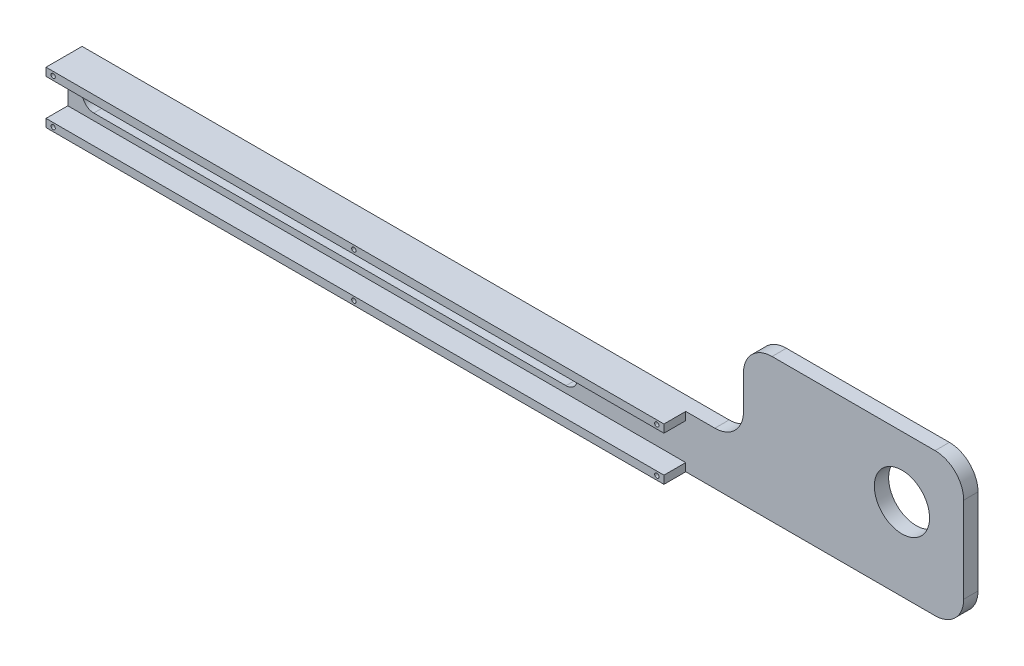
ISO-10303-21;
HEADER;
FILE_DESCRIPTION(('STEP AP214'),'2;1');
FILE_NAME('part.step','',(''),(''),'','','');
FILE_SCHEMA(('AUTOMOTIVE_DESIGN { 1 0 10303 214 1 1 1 1 }'));
ENDSEC;
DATA;
#1=APPLICATION_CONTEXT('core data for automotive mechanical design processes');
#2=APPLICATION_PROTOCOL_DEFINITION('international standard','automotive_design',2000,#1);
#3=PRODUCT_CONTEXT('',#1,'mechanical');
#4=PRODUCT('Part','Part','',(#3));
#5=PRODUCT_RELATED_PRODUCT_CATEGORY('part','',(#4));
#6=PRODUCT_DEFINITION_FORMATION('','',#4);
#7=PRODUCT_DEFINITION_CONTEXT('part definition',#1,'design');
#8=PRODUCT_DEFINITION('design','',#6,#7);
#9=PRODUCT_DEFINITION_SHAPE('','',#8);
#10=(LENGTH_UNIT() NAMED_UNIT(*) SI_UNIT(.MILLI.,.METRE.));
#11=(NAMED_UNIT(*) PLANE_ANGLE_UNIT() SI_UNIT($,.RADIAN.));
#12=(NAMED_UNIT(*) SI_UNIT($,.STERADIAN.) SOLID_ANGLE_UNIT());
#13=UNCERTAINTY_MEASURE_WITH_UNIT(LENGTH_MEASURE(1.E-05),#10,'distance_accuracy_value','');
#14=(GEOMETRIC_REPRESENTATION_CONTEXT(3) GLOBAL_UNCERTAINTY_ASSIGNED_CONTEXT((#13)) GLOBAL_UNIT_ASSIGNED_CONTEXT((#10,
#11,#12)) REPRESENTATION_CONTEXT('',''));
#15=CARTESIAN_POINT('',(0.,0.,0.));
#16=DIRECTION('',(0.,0.,1.));
#17=DIRECTION('',(1.,0.,0.));
#18=AXIS2_PLACEMENT_3D('',#15,#16,#17);
#19=CARTESIAN_POINT('',(0.,0.,5.));
#20=DIRECTION('',(0.,0.,1.));
#21=DIRECTION('',(1.,0.,0.));
#22=AXIS2_PLACEMENT_3D('',#19,#20,#21);
#23=PLANE('',#22);
#24=CARTESIAN_POINT('',(174.18,9.144,5.));
#25=DIRECTION('',(0.,0.,1.));
#26=DIRECTION('',(1.,0.,0.));
#27=AXIS2_PLACEMENT_3D('',#24,#25,#26);
#28=CIRCLE('',#27,4.);
#29=CARTESIAN_POINT('',(174.18,5.144,5.));
#30=VERTEX_POINT('',#29);
#31=CARTESIAN_POINT('',(174.18,13.144,5.));
#32=VERTEX_POINT('',#31);
#33=EDGE_CURVE('E267',#30,#32,#28,.T.);
#34=ORIENTED_EDGE('',*,*,#33,.F.);
#35=DIRECTION('',(1.,0.,0.));
#36=VECTOR('',#35,1.);
#37=CARTESIAN_POINT('',(0.,5.144,5.));
#38=LINE('',#37,#36);
#39=CARTESIAN_POINT('',(9.08,5.144,5.));
#40=VERTEX_POINT('',#39);
#41=EDGE_CURVE('E271',#40,#30,#38,.T.);
#42=ORIENTED_EDGE('',*,*,#41,.F.);
#43=CARTESIAN_POINT('',(9.08,9.144,5.));
#44=DIRECTION('',(0.,0.,1.));
#45=DIRECTION('',(1.,0.,0.));
#46=AXIS2_PLACEMENT_3D('',#43,#44,#45);
#47=CIRCLE('',#46,4.);
#48=CARTESIAN_POINT('',(9.08,13.144,5.));
#49=VERTEX_POINT('',#48);
#50=EDGE_CURVE('E276',#49,#40,#47,.T.);
#51=ORIENTED_EDGE('',*,*,#50,.F.);
#52=DIRECTION('',(1.,0.,0.));
#53=VECTOR('',#52,1.);
#54=CARTESIAN_POINT('',(0.,13.144,5.));
#55=LINE('',#54,#53);
#56=EDGE_CURVE('E280',#49,#32,#55,.T.);
#57=ORIENTED_EDGE('',*,*,#56,.T.);
#58=EDGE_LOOP('',(#34,#42,#51,#57));
#59=FACE_BOUND('',#58,.T.);
#60=CARTESIAN_POINT('',(291.63,28.638,5.));
#61=DIRECTION('',(0.,0.,1.));
#62=DIRECTION('',(1.,0.,0.));
#63=AXIS2_PLACEMENT_3D('',#60,#61,#62);
#64=CIRCLE('',#63,9.65199999999998);
#65=CARTESIAN_POINT('',(301.282,28.638,5.));
#66=VERTEX_POINT('',#65);
#67=EDGE_CURVE('E303',#66,#66,#64,.T.);
#68=ORIENTED_EDGE('',*,*,#67,.F.);
#69=EDGE_LOOP('',(#68));
#70=FACE_BOUND('',#69,.T.);
#71=DIRECTION('',(-1.,0.,0.));
#72=VECTOR('',#71,1.);
#73=CARTESIAN_POINT('',(0.,2.794,5.));
#74=LINE('',#73,#72);
#75=CARTESIAN_POINT('',(216.043861244439,2.79400000000005,5.));
#76=VERTEX_POINT('',#75);
#77=CARTESIAN_POINT('',(0.,2.794,5.));
#78=VERTEX_POINT('',#77);
#79=EDGE_CURVE('E209',#76,#78,#74,.T.);
#80=ORIENTED_EDGE('',*,*,#79,.F.);
#81=DIRECTION('',(0.,1.,0.));
#82=VECTOR('',#81,1.);
#83=CARTESIAN_POINT('',(216.043861244439,0.,5.));
#84=LINE('',#83,#82);
#85=CARTESIAN_POINT('',(216.043861244439,0.,5.));
#86=VERTEX_POINT('',#85);
#87=EDGE_CURVE('E212',#86,#76,#84,.T.);
#88=ORIENTED_EDGE('',*,*,#87,.F.);
#89=DIRECTION('',(1.,0.,0.));
#90=VECTOR('',#89,1.);
#91=CARTESIAN_POINT('',(0.,0.,5.));
#92=LINE('',#91,#90);
#93=CARTESIAN_POINT('',(303.22,0.,5.));
#94=VERTEX_POINT('',#93);
#95=EDGE_CURVE('E283',#86,#94,#92,.T.);
#96=ORIENTED_EDGE('',*,*,#95,.T.);
#97=CARTESIAN_POINT('',(303.22,10.,5.));
#98=DIRECTION('',(0.,0.,1.));
#99=DIRECTION('',(1.,0.,0.));
#100=AXIS2_PLACEMENT_3D('',#97,#98,#99);
#101=CIRCLE('',#100,10.);
#102=CARTESIAN_POINT('',(313.22,10.,5.));
#103=VERTEX_POINT('',#102);
#104=EDGE_CURVE('E385',#94,#103,#101,.T.);
#105=ORIENTED_EDGE('',*,*,#104,.T.);
#106=DIRECTION('',(0.,1.,0.));
#107=VECTOR('',#106,1.);
#108=CARTESIAN_POINT('',(313.22,0.,5.));
#109=LINE('',#108,#107);
#110=CARTESIAN_POINT('',(313.22,40.,5.));
#111=VERTEX_POINT('',#110);
#112=EDGE_CURVE('E286',#103,#111,#109,.T.);
#113=ORIENTED_EDGE('',*,*,#112,.T.);
#114=CARTESIAN_POINT('',(303.22,40.,5.));
#115=DIRECTION('',(0.,0.,1.));
#116=DIRECTION('',(1.,0.,0.));
#117=AXIS2_PLACEMENT_3D('',#114,#115,#116);
#118=CIRCLE('',#117,10.);
#119=CARTESIAN_POINT('',(303.22,50.,5.));
#120=VERTEX_POINT('',#119);
#121=EDGE_CURVE('E382',#111,#120,#118,.T.);
#122=ORIENTED_EDGE('',*,*,#121,.T.);
#123=DIRECTION('',(1.,0.,0.));
#124=VECTOR('',#123,1.);
#125=CARTESIAN_POINT('',(0.,50.,5.));
#126=LINE('',#125,#124);
#127=CARTESIAN_POINT('',(246.22,50.,5.));
#128=VERTEX_POINT('',#127);
#129=EDGE_CURVE('E290',#128,#120,#126,.T.);
#130=ORIENTED_EDGE('',*,*,#129,.F.);
#131=CARTESIAN_POINT('',(246.22,40.,5.));
#132=DIRECTION('',(0.,0.,1.));
#133=DIRECTION('',(1.,0.,0.));
#134=AXIS2_PLACEMENT_3D('',#131,#132,#133);
#135=CIRCLE('',#134,10.);
#136=CARTESIAN_POINT('',(236.22,40.,5.));
#137=VERTEX_POINT('',#136);
#138=EDGE_CURVE('E379',#128,#137,#135,.T.);
#139=ORIENTED_EDGE('',*,*,#138,.T.);
#140=DIRECTION('',(0.,1.,0.));
#141=VECTOR('',#140,1.);
#142=CARTESIAN_POINT('',(236.22,0.,5.));
#143=LINE('',#142,#141);
#144=CARTESIAN_POINT('',(236.22,28.288,5.));
#145=VERTEX_POINT('',#144);
#146=EDGE_CURVE('E294',#145,#137,#143,.T.);
#147=ORIENTED_EDGE('',*,*,#146,.F.);
#148=CARTESIAN_POINT('',(226.22,28.288,5.));
#149=DIRECTION('',(0.,0.,1.));
#150=DIRECTION('',(1.,0.,0.));
#151=AXIS2_PLACEMENT_3D('',#148,#149,#150);
#152=CIRCLE('',#151,10.);
#153=CARTESIAN_POINT('',(226.22,18.288,5.));
#154=VERTEX_POINT('',#153);
#155=EDGE_CURVE('E11',#145,#154,#152,.F.);
#156=ORIENTED_EDGE('',*,*,#155,.T.);
#157=DIRECTION('',(1.,0.,0.));
#158=VECTOR('',#157,1.);
#159=CARTESIAN_POINT('',(0.,18.288,5.));
#160=LINE('',#159,#158);
#161=CARTESIAN_POINT('',(216.043861244439,18.288,5.));
#162=VERTEX_POINT('',#161);
#163=EDGE_CURVE('E298',#162,#154,#160,.T.);
#164=ORIENTED_EDGE('',*,*,#163,.F.);
#165=DIRECTION('',(0.,1.,0.));
#166=VECTOR('',#165,1.);
#167=CARTESIAN_POINT('',(216.043861244439,18.288,5.));
#168=LINE('',#167,#166);
#169=CARTESIAN_POINT('',(216.043861244439,15.494,5.));
#170=VERTEX_POINT('',#169);
#171=EDGE_CURVE('E238',#170,#162,#168,.T.);
#172=ORIENTED_EDGE('',*,*,#171,.F.);
#173=DIRECTION('',(1.,0.,0.));
#174=VECTOR('',#173,1.);
#175=CARTESIAN_POINT('',(0.,15.494,5.));
#176=LINE('',#175,#174);
#177=CARTESIAN_POINT('',(0.,15.494,5.));
#178=VERTEX_POINT('',#177);
#179=EDGE_CURVE('E232',#178,#170,#176,.T.);
#180=ORIENTED_EDGE('',*,*,#179,.F.);
#181=DIRECTION('',(0.,1.,0.));
#182=VECTOR('',#181,1.);
#183=CARTESIAN_POINT('',(0.,0.,5.));
#184=LINE('',#183,#182);
#185=EDGE_CURVE('E65',#78,#178,#184,.T.);
#186=ORIENTED_EDGE('',*,*,#185,.F.);
#187=EDGE_LOOP('',(#80,#88,#96,#105,#113,#122,#130,#139,#147,#156,#164,#172,#180,#186));
#188=FACE_BOUND('',#187,.T.);
#189=ADVANCED_FACE('F41',(#59,#70,#188),#23,.T.);
#190=CARTESIAN_POINT('',(0.,0.,5.));
#191=DIRECTION('',(0.,1.,0.));
#192=DIRECTION('',(0.,0.,1.));
#193=AXIS2_PLACEMENT_3D('',#190,#191,#192);
#194=PLANE('',#193);
#195=DIRECTION('',(1.,0.,0.));
#196=VECTOR('',#195,1.);
#197=CARTESIAN_POINT('',(0.,0.,0.));
#198=LINE('',#197,#196);
#199=CARTESIAN_POINT('',(0.,0.,0.));
#200=VERTEX_POINT('',#199);
#201=CARTESIAN_POINT('',(303.22,0.,0.));
#202=VERTEX_POINT('',#201);
#203=EDGE_CURVE('E323',#200,#202,#198,.T.);
#204=ORIENTED_EDGE('',*,*,#203,.T.);
#205=DIRECTION('',(0.,0.,-1.));
#206=VECTOR('',#205,1.);
#207=CARTESIAN_POINT('',(303.22,0.,5.));
#208=LINE('',#207,#206);
#209=EDGE_CURVE('E375',#202,#94,#208,.F.);
#210=ORIENTED_EDGE('',*,*,#209,.T.);
#211=ORIENTED_EDGE('',*,*,#95,.F.);
#212=DIRECTION('',(0.,0.,-1.));
#213=VECTOR('',#212,1.);
#214=CARTESIAN_POINT('',(216.043861244439,0.,12.62));
#215=LINE('',#214,#213);
#216=CARTESIAN_POINT('',(216.043861244439,0.,12.62));
#217=VERTEX_POINT('',#216);
#218=EDGE_CURVE('E199',#217,#86,#215,.T.);
#219=ORIENTED_EDGE('',*,*,#218,.F.);
#220=DIRECTION('',(1.,0.,0.));
#221=VECTOR('',#220,1.);
#222=CARTESIAN_POINT('',(0.,0.,12.62));
#223=LINE('',#222,#221);
#224=CARTESIAN_POINT('',(0.,0.,12.62));
#225=VERTEX_POINT('',#224);
#226=EDGE_CURVE('E196',#225,#217,#223,.T.);
#227=ORIENTED_EDGE('',*,*,#226,.F.);
#228=DIRECTION('',(0.,0.,-1.));
#229=VECTOR('',#228,1.);
#230=CARTESIAN_POINT('',(0.,0.,5.));
#231=LINE('',#230,#229);
#232=EDGE_CURVE('E181',#225,#200,#231,.T.);
#233=ORIENTED_EDGE('',*,*,#232,.T.);
#234=EDGE_LOOP('',(#204,#210,#211,#219,#227,#233));
#235=FACE_BOUND('',#234,.T.);
#236=ADVANCED_FACE('F197',(#235),#194,.F.);
#237=CARTESIAN_POINT('',(313.22,0.,5.));
#238=DIRECTION('',(-1.,0.,0.));
#239=DIRECTION('',(0.,0.,1.));
#240=AXIS2_PLACEMENT_3D('',#237,#238,#239);
#241=PLANE('',#240);
#242=ORIENTED_EDGE('',*,*,#112,.F.);
#243=DIRECTION('',(0.,0.,-1.));
#244=VECTOR('',#243,1.);
#245=CARTESIAN_POINT('',(313.22,10.,5.));
#246=LINE('',#245,#244);
#247=CARTESIAN_POINT('',(313.22,10.,0.));
#248=VERTEX_POINT('',#247);
#249=EDGE_CURVE('E362',#103,#248,#246,.T.);
#250=ORIENTED_EDGE('',*,*,#249,.T.);
#251=DIRECTION('',(0.,1.,0.));
#252=VECTOR('',#251,1.);
#253=CARTESIAN_POINT('',(313.22,0.,0.));
#254=LINE('',#253,#252);
#255=CARTESIAN_POINT('',(313.22,40.,0.));
#256=VERTEX_POINT('',#255);
#257=EDGE_CURVE('E326',#248,#256,#254,.T.);
#258=ORIENTED_EDGE('',*,*,#257,.T.);
#259=DIRECTION('',(0.,0.,-1.));
#260=VECTOR('',#259,1.);
#261=CARTESIAN_POINT('',(313.22,40.,5.));
#262=LINE('',#261,#260);
#263=EDGE_CURVE('E349',#256,#111,#262,.F.);
#264=ORIENTED_EDGE('',*,*,#263,.T.);
#265=EDGE_LOOP('',(#242,#250,#258,#264));
#266=FACE_BOUND('',#265,.T.);
#267=ADVANCED_FACE('F437',(#266),#241,.F.);
#268=CARTESIAN_POINT('',(0.,50.,5.));
#269=DIRECTION('',(0.,1.,0.));
#270=DIRECTION('',(0.,0.,1.));
#271=AXIS2_PLACEMENT_3D('',#268,#269,#270);
#272=PLANE('',#271);
#273=ORIENTED_EDGE('',*,*,#129,.T.);
#274=DIRECTION('',(0.,0.,-1.));
#275=VECTOR('',#274,1.);
#276=CARTESIAN_POINT('',(303.22,50.,0.));
#277=LINE('',#276,#275);
#278=CARTESIAN_POINT('',(303.22,50.,0.));
#279=VERTEX_POINT('',#278);
#280=EDGE_CURVE('E391',#120,#279,#277,.T.);
#281=ORIENTED_EDGE('',*,*,#280,.T.);
#282=DIRECTION('',(1.,0.,0.));
#283=VECTOR('',#282,1.);
#284=CARTESIAN_POINT('',(0.,50.,0.));
#285=LINE('',#284,#283);
#286=CARTESIAN_POINT('',(246.22,50.,0.));
#287=VERTEX_POINT('',#286);
#288=EDGE_CURVE('E330',#287,#279,#285,.T.);
#289=ORIENTED_EDGE('',*,*,#288,.F.);
#290=DIRECTION('',(0.,0.,-1.));
#291=VECTOR('',#290,1.);
#292=CARTESIAN_POINT('',(246.22,50.,5.));
#293=LINE('',#292,#291);
#294=EDGE_CURVE('E388',#287,#128,#293,.F.);
#295=ORIENTED_EDGE('',*,*,#294,.T.);
#296=EDGE_LOOP('',(#273,#281,#289,#295));
#297=FACE_BOUND('',#296,.T.);
#298=ADVANCED_FACE('F429',(#297),#272,.T.);
#299=CARTESIAN_POINT('',(236.22,0.,5.));
#300=DIRECTION('',(-1.,0.,0.));
#301=DIRECTION('',(0.,0.,1.));
#302=AXIS2_PLACEMENT_3D('',#299,#300,#301);
#303=PLANE('',#302);
#304=ORIENTED_EDGE('',*,*,#146,.T.);
#305=DIRECTION('',(0.,0.,-1.));
#306=VECTOR('',#305,1.);
#307=CARTESIAN_POINT('',(236.22,40.,5.));
#308=LINE('',#307,#306);
#309=CARTESIAN_POINT('',(236.22,40.,0.));
#310=VERTEX_POINT('',#309);
#311=EDGE_CURVE('E398',#137,#310,#308,.T.);
#312=ORIENTED_EDGE('',*,*,#311,.T.);
#313=DIRECTION('',(0.,1.,0.));
#314=VECTOR('',#313,1.);
#315=CARTESIAN_POINT('',(236.22,0.,0.));
#316=LINE('',#315,#314);
#317=CARTESIAN_POINT('',(236.22,28.288,0.));
#318=VERTEX_POINT('',#317);
#319=EDGE_CURVE('E334',#318,#310,#316,.T.);
#320=ORIENTED_EDGE('',*,*,#319,.F.);
#321=DIRECTION('',(0.,0.,-1.));
#322=VECTOR('',#321,1.);
#323=CARTESIAN_POINT('',(236.22,28.288,5.));
#324=LINE('',#323,#322);
#325=EDGE_CURVE('E395',#318,#145,#324,.F.);
#326=ORIENTED_EDGE('',*,*,#325,.T.);
#327=EDGE_LOOP('',(#304,#312,#320,#326));
#328=FACE_BOUND('',#327,.T.);
#329=ADVANCED_FACE('F416',(#328),#303,.T.);
#330=CARTESIAN_POINT('',(0.,18.288,5.));
#331=DIRECTION('',(0.,1.,0.));
#332=DIRECTION('',(0.,0.,1.));
#333=AXIS2_PLACEMENT_3D('',#330,#331,#332);
#334=PLANE('',#333);
#335=DIRECTION('',(0.,0.,-1.));
#336=VECTOR('',#335,1.);
#337=CARTESIAN_POINT('',(0.,18.288,5.));
#338=LINE('',#337,#336);
#339=CARTESIAN_POINT('',(0.,18.288,12.62));
#340=VERTEX_POINT('',#339);
#341=CARTESIAN_POINT('',(0.,18.288,0.));
#342=VERTEX_POINT('',#341);
#343=EDGE_CURVE('E192',#340,#342,#338,.T.);
#344=ORIENTED_EDGE('',*,*,#343,.F.);
#345=DIRECTION('',(-1.,0.,0.));
#346=VECTOR('',#345,1.);
#347=CARTESIAN_POINT('',(0.,18.288,12.62));
#348=LINE('',#347,#346);
#349=CARTESIAN_POINT('',(216.043861244439,18.288,12.62));
#350=VERTEX_POINT('',#349);
#351=EDGE_CURVE('E244',#350,#340,#348,.T.);
#352=ORIENTED_EDGE('',*,*,#351,.F.);
#353=DIRECTION('',(0.,0.,-1.));
#354=VECTOR('',#353,1.);
#355=CARTESIAN_POINT('',(216.043861244439,18.288,12.62));
#356=LINE('',#355,#354);
#357=EDGE_CURVE('E248',#350,#162,#356,.T.);
#358=ORIENTED_EDGE('',*,*,#357,.T.);
#359=ORIENTED_EDGE('',*,*,#163,.T.);
#360=DIRECTION('',(0.,0.,-1.));
#361=VECTOR('',#360,1.);
#362=CARTESIAN_POINT('',(226.22,18.288,0.));
#363=LINE('',#362,#361);
#364=CARTESIAN_POINT('',(226.22,18.288,0.));
#365=VERTEX_POINT('',#364);
#366=EDGE_CURVE('E402',#154,#365,#363,.T.);
#367=ORIENTED_EDGE('',*,*,#366,.T.);
#368=DIRECTION('',(1.,0.,0.));
#369=VECTOR('',#368,1.);
#370=CARTESIAN_POINT('',(0.,18.288,0.));
#371=LINE('',#370,#369);
#372=EDGE_CURVE('E338',#342,#365,#371,.T.);
#373=ORIENTED_EDGE('',*,*,#372,.F.);
#374=EDGE_LOOP('',(#344,#352,#358,#359,#367,#373));
#375=FACE_BOUND('',#374,.T.);
#376=ADVANCED_FACE('F457',(#375),#334,.T.);
#377=CARTESIAN_POINT('',(174.18,9.144,5.));
#378=DIRECTION('',(0.,0.,-1.));
#379=DIRECTION('',(-1.,0.,0.));
#380=AXIS2_PLACEMENT_3D('',#377,#378,#379);
#381=CYLINDRICAL_SURFACE('',#380,4.);
#382=CARTESIAN_POINT('',(174.18,9.144,0.));
#383=DIRECTION('',(0.,0.,1.));
#384=DIRECTION('',(1.,0.,0.));
#385=AXIS2_PLACEMENT_3D('',#382,#383,#384);
#386=CIRCLE('',#385,4.);
#387=CARTESIAN_POINT('',(174.18,5.144,0.));
#388=VERTEX_POINT('',#387);
#389=CARTESIAN_POINT('',(174.18,13.144,0.));
#390=VERTEX_POINT('',#389);
#391=EDGE_CURVE('E266',#388,#390,#386,.T.);
#392=ORIENTED_EDGE('',*,*,#391,.F.);
#393=DIRECTION('',(0.,0.,-1.));
#394=VECTOR('',#393,1.);
#395=CARTESIAN_POINT('',(174.18,5.144,5.));
#396=LINE('',#395,#394);
#397=EDGE_CURVE('E193',#30,#388,#396,.T.);
#398=ORIENTED_EDGE('',*,*,#397,.F.);
#399=ORIENTED_EDGE('',*,*,#33,.T.);
#400=DIRECTION('',(0.,0.,-1.));
#401=VECTOR('',#400,1.);
#402=CARTESIAN_POINT('',(174.18,13.144,5.));
#403=LINE('',#402,#401);
#404=EDGE_CURVE('E307',#32,#390,#403,.T.);
#405=ORIENTED_EDGE('',*,*,#404,.T.);
#406=EDGE_LOOP('',(#392,#398,#399,#405));
#407=FACE_BOUND('',#406,.T.);
#408=ADVANCED_FACE('F492',(#407),#381,.F.);
#409=CARTESIAN_POINT('',(0.,5.144,5.));
#410=DIRECTION('',(0.,1.,0.));
#411=DIRECTION('',(0.,0.,1.));
#412=AXIS2_PLACEMENT_3D('',#409,#410,#411);
#413=PLANE('',#412);
#414=DIRECTION('',(1.,0.,0.));
#415=VECTOR('',#414,1.);
#416=CARTESIAN_POINT('',(0.,5.144,0.));
#417=LINE('',#416,#415);
#418=CARTESIAN_POINT('',(9.08,5.144,0.));
#419=VERTEX_POINT('',#418);
#420=EDGE_CURVE('E311',#419,#388,#417,.T.);
#421=ORIENTED_EDGE('',*,*,#420,.F.);
#422=DIRECTION('',(0.,0.,-1.));
#423=VECTOR('',#422,1.);
#424=CARTESIAN_POINT('',(9.08,5.144,5.));
#425=LINE('',#424,#423);
#426=EDGE_CURVE('E355',#40,#419,#425,.T.);
#427=ORIENTED_EDGE('',*,*,#426,.F.);
#428=ORIENTED_EDGE('',*,*,#41,.T.);
#429=ORIENTED_EDGE('',*,*,#397,.T.);
#430=EDGE_LOOP('',(#421,#427,#428,#429));
#431=FACE_BOUND('',#430,.T.);
#432=ADVANCED_FACE('F504',(#431),#413,.T.);
#433=CARTESIAN_POINT('',(9.08,9.144,5.));
#434=DIRECTION('',(0.,0.,-1.));
#435=DIRECTION('',(-1.,0.,0.));
#436=AXIS2_PLACEMENT_3D('',#433,#434,#435);
#437=CYLINDRICAL_SURFACE('',#436,4.);
#438=CARTESIAN_POINT('',(9.08,9.144,0.));
#439=DIRECTION('',(0.,0.,1.));
#440=DIRECTION('',(1.,0.,0.));
#441=AXIS2_PLACEMENT_3D('',#438,#439,#440);
#442=CIRCLE('',#441,4.);
#443=CARTESIAN_POINT('',(9.08,13.144,0.));
#444=VERTEX_POINT('',#443);
#445=EDGE_CURVE('E315',#444,#419,#442,.T.);
#446=ORIENTED_EDGE('',*,*,#445,.F.);
#447=DIRECTION('',(0.,0.,-1.));
#448=VECTOR('',#447,1.);
#449=CARTESIAN_POINT('',(9.08,13.144,5.));
#450=LINE('',#449,#448);
#451=EDGE_CURVE('E352',#49,#444,#450,.T.);
#452=ORIENTED_EDGE('',*,*,#451,.F.);
#453=ORIENTED_EDGE('',*,*,#50,.T.);
#454=ORIENTED_EDGE('',*,*,#426,.T.);
#455=EDGE_LOOP('',(#446,#452,#453,#454));
#456=FACE_BOUND('',#455,.T.);
#457=ADVANCED_FACE('F489',(#456),#437,.F.);
#458=CARTESIAN_POINT('',(0.,0.,5.));
#459=DIRECTION('',(-1.,0.,0.));
#460=DIRECTION('',(0.,0.,1.));
#461=AXIS2_PLACEMENT_3D('',#458,#459,#460);
#462=PLANE('',#461);
#463=DIRECTION('',(0.,1.,0.));
#464=VECTOR('',#463,1.);
#465=CARTESIAN_POINT('',(0.,0.,0.));
#466=LINE('',#465,#464);
#467=EDGE_CURVE('E187',#200,#342,#466,.T.);
#468=ORIENTED_EDGE('',*,*,#467,.F.);
#469=ORIENTED_EDGE('',*,*,#232,.F.);
#470=DIRECTION('',(0.,-1.,0.));
#471=VECTOR('',#470,1.);
#472=CARTESIAN_POINT('',(0.,0.,12.62));
#473=LINE('',#472,#471);
#474=CARTESIAN_POINT('',(0.,2.794,12.62));
#475=VERTEX_POINT('',#474);
#476=EDGE_CURVE('E185',#475,#225,#473,.T.);
#477=ORIENTED_EDGE('',*,*,#476,.F.);
#478=DIRECTION('',(0.,0.,-1.));
#479=VECTOR('',#478,1.);
#480=CARTESIAN_POINT('',(0.,2.794,12.62));
#481=LINE('',#480,#479);
#482=EDGE_CURVE('E222',#475,#78,#481,.T.);
#483=ORIENTED_EDGE('',*,*,#482,.T.);
#484=ORIENTED_EDGE('',*,*,#185,.T.);
#485=DIRECTION('',(0.,0.,-1.));
#486=VECTOR('',#485,1.);
#487=CARTESIAN_POINT('',(0.,15.494,12.62));
#488=LINE('',#487,#486);
#489=CARTESIAN_POINT('',(0.,15.494,12.62));
#490=VERTEX_POINT('',#489);
#491=EDGE_CURVE('E262',#490,#178,#488,.T.);
#492=ORIENTED_EDGE('',*,*,#491,.F.);
#493=DIRECTION('',(0.,-1.,0.));
#494=VECTOR('',#493,1.);
#495=CARTESIAN_POINT('',(0.,18.288,12.62));
#496=LINE('',#495,#494);
#497=EDGE_CURVE('E233',#340,#490,#496,.T.);
#498=ORIENTED_EDGE('',*,*,#497,.F.);
#499=ORIENTED_EDGE('',*,*,#343,.T.);
#500=EDGE_LOOP('',(#468,#469,#477,#483,#484,#492,#498,#499));
#501=FACE_BOUND('',#500,.T.);
#502=ADVANCED_FACE('F183',(#501),#462,.T.);
#503=CARTESIAN_POINT('',(0.,13.144,5.));
#504=DIRECTION('',(0.,1.,0.));
#505=DIRECTION('',(0.,0.,1.));
#506=AXIS2_PLACEMENT_3D('',#503,#504,#505);
#507=PLANE('',#506);
#508=DIRECTION('',(1.,0.,0.));
#509=VECTOR('',#508,1.);
#510=CARTESIAN_POINT('',(0.,13.144,0.));
#511=LINE('',#510,#509);
#512=EDGE_CURVE('E319',#444,#390,#511,.T.);
#513=ORIENTED_EDGE('',*,*,#512,.T.);
#514=ORIENTED_EDGE('',*,*,#404,.F.);
#515=ORIENTED_EDGE('',*,*,#56,.F.);
#516=ORIENTED_EDGE('',*,*,#451,.T.);
#517=EDGE_LOOP('',(#513,#514,#515,#516));
#518=FACE_BOUND('',#517,.T.);
#519=ADVANCED_FACE('F485',(#518),#507,.F.);
#520=CARTESIAN_POINT('',(291.63,28.638,5.));
#521=DIRECTION('',(0.,0.,-1.));
#522=DIRECTION('',(-1.,0.,0.));
#523=AXIS2_PLACEMENT_3D('',#520,#521,#522);
#524=CYLINDRICAL_SURFACE('',#523,9.65199999999998);
#525=ORIENTED_EDGE('',*,*,#67,.T.);
#526=EDGE_LOOP('',(#525));
#527=FACE_BOUND('',#526,.T.);
#528=CARTESIAN_POINT('',(291.63,28.638,0.));
#529=DIRECTION('',(0.,0.,1.));
#530=DIRECTION('',(1.,0.,0.));
#531=AXIS2_PLACEMENT_3D('',#528,#529,#530);
#532=CIRCLE('',#531,9.65199999999998);
#533=CARTESIAN_POINT('',(301.282,28.638,0.));
#534=VERTEX_POINT('',#533);
#535=EDGE_CURVE('E272',#534,#534,#532,.T.);
#536=ORIENTED_EDGE('',*,*,#535,.F.);
#537=EDGE_LOOP('',(#536));
#538=FACE_BOUND('',#537,.T.);
#539=ADVANCED_FACE('F481',(#527,#538),#524,.F.);
#540=CARTESIAN_POINT('',(0.,0.,0.));
#541=DIRECTION('',(0.,0.,1.));
#542=DIRECTION('',(1.,0.,0.));
#543=AXIS2_PLACEMENT_3D('',#540,#541,#542);
#544=PLANE('',#543);
#545=ORIENTED_EDGE('',*,*,#391,.T.);
#546=ORIENTED_EDGE('',*,*,#512,.F.);
#547=ORIENTED_EDGE('',*,*,#445,.T.);
#548=ORIENTED_EDGE('',*,*,#420,.T.);
#549=EDGE_LOOP('',(#545,#546,#547,#548));
#550=FACE_BOUND('',#549,.T.);
#551=ORIENTED_EDGE('',*,*,#257,.F.);
#552=CARTESIAN_POINT('',(303.22,10.,0.));
#553=DIRECTION('',(0.,0.,1.));
#554=DIRECTION('',(1.,0.,0.));
#555=AXIS2_PLACEMENT_3D('',#552,#553,#554);
#556=CIRCLE('',#555,10.);
#557=EDGE_CURVE('E372',#248,#202,#556,.F.);
#558=ORIENTED_EDGE('',*,*,#557,.T.);
#559=ORIENTED_EDGE('',*,*,#203,.F.);
#560=ORIENTED_EDGE('',*,*,#467,.T.);
#561=ORIENTED_EDGE('',*,*,#372,.T.);
#562=CARTESIAN_POINT('',(226.22,28.288,0.));
#563=DIRECTION('',(0.,0.,1.));
#564=DIRECTION('',(1.,0.,0.));
#565=AXIS2_PLACEMENT_3D('',#562,#563,#564);
#566=CIRCLE('',#565,10.);
#567=EDGE_CURVE('E50',#365,#318,#566,.T.);
#568=ORIENTED_EDGE('',*,*,#567,.T.);
#569=ORIENTED_EDGE('',*,*,#319,.T.);
#570=CARTESIAN_POINT('',(246.22,40.,0.));
#571=DIRECTION('',(0.,0.,1.));
#572=DIRECTION('',(1.,0.,0.));
#573=AXIS2_PLACEMENT_3D('',#570,#571,#572);
#574=CIRCLE('',#573,10.);
#575=EDGE_CURVE('E366',#310,#287,#574,.F.);
#576=ORIENTED_EDGE('',*,*,#575,.T.);
#577=ORIENTED_EDGE('',*,*,#288,.T.);
#578=CARTESIAN_POINT('',(303.22,40.,0.));
#579=DIRECTION('',(0.,0.,1.));
#580=DIRECTION('',(1.,0.,0.));
#581=AXIS2_PLACEMENT_3D('',#578,#579,#580);
#582=CIRCLE('',#581,10.);
#583=EDGE_CURVE('E369',#279,#256,#582,.F.);
#584=ORIENTED_EDGE('',*,*,#583,.T.);
#585=EDGE_LOOP('',(#551,#558,#559,#560,#561,#568,#569,#576,#577,#584));
#586=FACE_BOUND('',#585,.T.);
#587=ORIENTED_EDGE('',*,*,#535,.T.);
#588=EDGE_LOOP('',(#587));
#589=FACE_BOUND('',#588,.T.);
#590=ADVANCED_FACE('F409',(#550,#586,#589),#544,.F.);
#591=CARTESIAN_POINT('',(303.22,10.,5.));
#592=DIRECTION('',(0.,0.,-1.));
#593=DIRECTION('',(-1.,0.,0.));
#594=AXIS2_PLACEMENT_3D('',#591,#592,#593);
#595=CYLINDRICAL_SURFACE('',#594,10.);
#596=ORIENTED_EDGE('',*,*,#104,.F.);
#597=ORIENTED_EDGE('',*,*,#209,.F.);
#598=ORIENTED_EDGE('',*,*,#557,.F.);
#599=ORIENTED_EDGE('',*,*,#249,.F.);
#600=EDGE_LOOP('',(#596,#597,#598,#599));
#601=FACE_BOUND('',#600,.T.);
#602=ADVANCED_FACE('F441',(#601),#595,.T.);
#603=CARTESIAN_POINT('',(303.22,40.,5.));
#604=DIRECTION('',(0.,0.,1.));
#605=DIRECTION('',(1.,0.,0.));
#606=AXIS2_PLACEMENT_3D('',#603,#604,#605);
#607=CYLINDRICAL_SURFACE('',#606,10.);
#608=ORIENTED_EDGE('',*,*,#121,.F.);
#609=ORIENTED_EDGE('',*,*,#263,.F.);
#610=ORIENTED_EDGE('',*,*,#583,.F.);
#611=ORIENTED_EDGE('',*,*,#280,.F.);
#612=EDGE_LOOP('',(#608,#609,#610,#611));
#613=FACE_BOUND('',#612,.T.);
#614=ADVANCED_FACE('F433',(#613),#607,.T.);
#615=CARTESIAN_POINT('',(246.22,40.,5.));
#616=DIRECTION('',(0.,0.,-1.));
#617=DIRECTION('',(-1.,0.,0.));
#618=AXIS2_PLACEMENT_3D('',#615,#616,#617);
#619=CYLINDRICAL_SURFACE('',#618,10.);
#620=ORIENTED_EDGE('',*,*,#138,.F.);
#621=ORIENTED_EDGE('',*,*,#294,.F.);
#622=ORIENTED_EDGE('',*,*,#575,.F.);
#623=ORIENTED_EDGE('',*,*,#311,.F.);
#624=EDGE_LOOP('',(#620,#621,#622,#623));
#625=FACE_BOUND('',#624,.T.);
#626=ADVANCED_FACE('F425',(#625),#619,.T.);
#627=CARTESIAN_POINT('',(226.22,28.288,5.));
#628=DIRECTION('',(0.,0.,1.));
#629=DIRECTION('',(1.,0.,0.));
#630=AXIS2_PLACEMENT_3D('',#627,#628,#629);
#631=CYLINDRICAL_SURFACE('',#630,10.);
#632=ORIENTED_EDGE('',*,*,#155,.F.);
#633=ORIENTED_EDGE('',*,*,#325,.F.);
#634=ORIENTED_EDGE('',*,*,#567,.F.);
#635=ORIENTED_EDGE('',*,*,#366,.F.);
#636=EDGE_LOOP('',(#632,#633,#634,#635));
#637=FACE_BOUND('',#636,.T.);
#638=ADVANCED_FACE('F43',(#637),#631,.F.);
#639=CARTESIAN_POINT('',(0.,15.494,12.62));
#640=DIRECTION('',(0.,1.,0.));
#641=DIRECTION('',(0.,0.,1.));
#642=AXIS2_PLACEMENT_3D('',#639,#640,#641);
#643=PLANE('',#642);
#644=ORIENTED_EDGE('',*,*,#179,.T.);
#645=DIRECTION('',(0.,0.,-1.));
#646=VECTOR('',#645,1.);
#647=CARTESIAN_POINT('',(216.043861244439,15.494,12.62));
#648=LINE('',#647,#646);
#649=CARTESIAN_POINT('',(216.043861244439,15.494,12.62));
#650=VERTEX_POINT('',#649);
#651=EDGE_CURVE('E258',#650,#170,#648,.T.);
#652=ORIENTED_EDGE('',*,*,#651,.F.);
#653=DIRECTION('',(1.,0.,0.));
#654=VECTOR('',#653,1.);
#655=CARTESIAN_POINT('',(0.,15.494,12.62));
#656=LINE('',#655,#654);
#657=EDGE_CURVE('E237',#490,#650,#656,.T.);
#658=ORIENTED_EDGE('',*,*,#657,.F.);
#659=ORIENTED_EDGE('',*,*,#491,.T.);
#660=EDGE_LOOP('',(#644,#652,#658,#659));
#661=FACE_BOUND('',#660,.T.);
#662=ADVANCED_FACE('F449',(#661),#643,.F.);
#663=CARTESIAN_POINT('',(216.043861244439,18.288,12.62));
#664=DIRECTION('',(-1.,0.,0.));
#665=DIRECTION('',(0.,0.,1.));
#666=AXIS2_PLACEMENT_3D('',#663,#664,#665);
#667=PLANE('',#666);
#668=ORIENTED_EDGE('',*,*,#171,.T.);
#669=ORIENTED_EDGE('',*,*,#357,.F.);
#670=DIRECTION('',(0.,1.,0.));
#671=VECTOR('',#670,1.);
#672=CARTESIAN_POINT('',(216.043861244439,18.288,12.62));
#673=LINE('',#672,#671);
#674=EDGE_CURVE('E241',#650,#350,#673,.T.);
#675=ORIENTED_EDGE('',*,*,#674,.F.);
#676=ORIENTED_EDGE('',*,*,#651,.T.);
#677=EDGE_LOOP('',(#668,#669,#675,#676));
#678=FACE_BOUND('',#677,.T.);
#679=ADVANCED_FACE('F459',(#678),#667,.F.);
#680=CARTESIAN_POINT('',(0.,0.,12.62));
#681=DIRECTION('',(0.,0.,1.));
#682=DIRECTION('',(1.,0.,0.));
#683=AXIS2_PLACEMENT_3D('',#680,#681,#682);
#684=PLANE('',#683);
#685=CARTESIAN_POINT('',(213.543861244439,16.891,12.62));
#686=DIRECTION('',(0.,0.,1.));
#687=DIRECTION('',(1.,0.,0.));
#688=AXIS2_PLACEMENT_3D('',#685,#686,#687);
#689=CIRCLE('',#688,0.750000000000012);
#690=CARTESIAN_POINT('',(214.293861244439,16.891,12.62));
#691=VERTEX_POINT('',#690);
#692=EDGE_CURVE('E693',#691,#691,#689,.T.);
#693=ORIENTED_EDGE('',*,*,#692,.F.);
#694=EDGE_LOOP('',(#693));
#695=FACE_BOUND('',#694,.T.);
#696=CARTESIAN_POINT('',(107.632192199668,16.891,12.62));
#697=DIRECTION('',(0.,0.,1.));
#698=DIRECTION('',(1.,0.,0.));
#699=AXIS2_PLACEMENT_3D('',#696,#697,#698);
#700=CIRCLE('',#699,0.749999999999999);
#701=CARTESIAN_POINT('',(108.382192199668,16.891,12.62));
#702=VERTEX_POINT('',#701);
#703=EDGE_CURVE('E717',#702,#702,#700,.T.);
#704=ORIENTED_EDGE('',*,*,#703,.F.);
#705=EDGE_LOOP('',(#704));
#706=FACE_BOUND('',#705,.T.);
#707=CARTESIAN_POINT('',(2.5,16.891,12.62));
#708=DIRECTION('',(0.,0.,1.));
#709=DIRECTION('',(1.,0.,0.));
#710=AXIS2_PLACEMENT_3D('',#707,#708,#709);
#711=CIRCLE('',#710,0.75);
#712=CARTESIAN_POINT('',(3.25,16.891,12.62));
#713=VERTEX_POINT('',#712);
#714=EDGE_CURVE('E215',#713,#713,#711,.T.);
#715=ORIENTED_EDGE('',*,*,#714,.F.);
#716=EDGE_LOOP('',(#715));
#717=FACE_BOUND('',#716,.T.);
#718=ORIENTED_EDGE('',*,*,#497,.T.);
#719=ORIENTED_EDGE('',*,*,#657,.T.);
#720=ORIENTED_EDGE('',*,*,#674,.T.);
#721=ORIENTED_EDGE('',*,*,#351,.T.);
#722=EDGE_LOOP('',(#718,#719,#720,#721));
#723=FACE_BOUND('',#722,.T.);
#724=ADVANCED_FACE('F452',(#695,#706,#717,#723),#684,.T.);
#725=CARTESIAN_POINT('',(216.043861244439,0.,12.62));
#726=DIRECTION('',(-1.,0.,0.));
#727=DIRECTION('',(0.,0.,1.));
#728=AXIS2_PLACEMENT_3D('',#725,#726,#727);
#729=PLANE('',#728);
#730=ORIENTED_EDGE('',*,*,#87,.T.);
#731=DIRECTION('',(0.,0.,-1.));
#732=VECTOR('',#731,1.);
#733=CARTESIAN_POINT('',(216.043861244439,2.79400000000005,12.62));
#734=LINE('',#733,#732);
#735=CARTESIAN_POINT('',(216.043861244439,2.79400000000005,12.62));
#736=VERTEX_POINT('',#735);
#737=EDGE_CURVE('E57',#736,#76,#734,.T.);
#738=ORIENTED_EDGE('',*,*,#737,.F.);
#739=DIRECTION('',(0.,1.,0.));
#740=VECTOR('',#739,1.);
#741=CARTESIAN_POINT('',(216.043861244439,0.,12.62));
#742=LINE('',#741,#740);
#743=EDGE_CURVE('E203',#217,#736,#742,.T.);
#744=ORIENTED_EDGE('',*,*,#743,.F.);
#745=ORIENTED_EDGE('',*,*,#218,.T.);
#746=EDGE_LOOP('',(#730,#738,#744,#745));
#747=FACE_BOUND('',#746,.T.);
#748=ADVANCED_FACE('F445',(#747),#729,.F.);
#749=CARTESIAN_POINT('',(0.,2.794,12.62));
#750=DIRECTION('',(0.,-1.,0.));
#751=DIRECTION('',(1.,0.,0.));
#752=AXIS2_PLACEMENT_3D('',#749,#750,#751);
#753=PLANE('',#752);
#754=ORIENTED_EDGE('',*,*,#79,.T.);
#755=ORIENTED_EDGE('',*,*,#482,.F.);
#756=DIRECTION('',(-1.,0.,0.));
#757=VECTOR('',#756,1.);
#758=CARTESIAN_POINT('',(0.,2.794,12.62));
#759=LINE('',#758,#757);
#760=EDGE_CURVE('E206',#736,#475,#759,.T.);
#761=ORIENTED_EDGE('',*,*,#760,.F.);
#762=ORIENTED_EDGE('',*,*,#737,.T.);
#763=EDGE_LOOP('',(#754,#755,#761,#762));
#764=FACE_BOUND('',#763,.T.);
#765=ADVANCED_FACE('F446',(#764),#753,.F.);
#766=CARTESIAN_POINT('',(0.,0.,12.62));
#767=DIRECTION('',(0.,0.,-1.));
#768=DIRECTION('',(-1.,0.,0.));
#769=AXIS2_PLACEMENT_3D('',#766,#767,#768);
#770=PLANE('',#769);
#771=CARTESIAN_POINT('',(107.632192199668,1.397,12.62));
#772=DIRECTION('',(0.,0.,1.));
#773=DIRECTION('',(1.,0.,0.));
#774=AXIS2_PLACEMENT_3D('',#771,#772,#773);
#775=CIRCLE('',#774,0.749999999999999);
#776=CARTESIAN_POINT('',(108.382192199668,1.397,12.62));
#777=VERTEX_POINT('',#776);
#778=EDGE_CURVE('E692',#777,#777,#775,.F.);
#779=ORIENTED_EDGE('',*,*,#778,.T.);
#780=EDGE_LOOP('',(#779));
#781=FACE_BOUND('',#780,.T.);
#782=CARTESIAN_POINT('',(2.5,1.397,12.62));
#783=DIRECTION('',(0.,0.,1.));
#784=DIRECTION('',(1.,0.,0.));
#785=AXIS2_PLACEMENT_3D('',#782,#783,#784);
#786=CIRCLE('',#785,0.75);
#787=CARTESIAN_POINT('',(3.25,1.397,12.62));
#788=VERTEX_POINT('',#787);
#789=EDGE_CURVE('E709',#788,#788,#786,.F.);
#790=ORIENTED_EDGE('',*,*,#789,.T.);
#791=EDGE_LOOP('',(#790));
#792=FACE_BOUND('',#791,.T.);
#793=CARTESIAN_POINT('',(213.543861244439,1.397,12.62));
#794=DIRECTION('',(0.,0.,1.));
#795=DIRECTION('',(1.,0.,0.));
#796=AXIS2_PLACEMENT_3D('',#793,#794,#795);
#797=CIRCLE('',#796,0.750000000000012);
#798=CARTESIAN_POINT('',(214.293861244439,1.397,12.62));
#799=VERTEX_POINT('',#798);
#800=EDGE_CURVE('E732',#799,#799,#797,.F.);
#801=ORIENTED_EDGE('',*,*,#800,.T.);
#802=EDGE_LOOP('',(#801));
#803=FACE_BOUND('',#802,.T.);
#804=ORIENTED_EDGE('',*,*,#476,.T.);
#805=ORIENTED_EDGE('',*,*,#226,.T.);
#806=ORIENTED_EDGE('',*,*,#743,.T.);
#807=ORIENTED_EDGE('',*,*,#760,.T.);
#808=EDGE_LOOP('',(#804,#805,#806,#807));
#809=FACE_BOUND('',#808,.T.);
#810=ADVANCED_FACE('F205',(#781,#792,#803,#809),#770,.F.);
#811=CARTESIAN_POINT('',(213.543861244439,1.397,7.62));
#812=DIRECTION('',(0.,0.,1.));
#813=DIRECTION('',(1.,0.,0.));
#814=AXIS2_PLACEMENT_3D('',#811,#812,#813);
#815=CYLINDRICAL_SURFACE('',#814,0.750000000000012);
#816=CARTESIAN_POINT('',(213.543861244439,1.397,7.62));
#817=DIRECTION('',(0.,0.,1.));
#818=DIRECTION('',(1.,0.,0.));
#819=AXIS2_PLACEMENT_3D('',#816,#817,#818);
#820=CIRCLE('',#819,0.750000000000012);
#821=CARTESIAN_POINT('',(214.293861244439,1.397,7.62));
#822=VERTEX_POINT('',#821);
#823=EDGE_CURVE('E701',#822,#822,#820,.F.);
#824=ORIENTED_EDGE('',*,*,#823,.T.);
#825=EDGE_LOOP('',(#824));
#826=FACE_BOUND('',#825,.T.);
#827=ORIENTED_EDGE('',*,*,#800,.F.);
#828=EDGE_LOOP('',(#827));
#829=FACE_BOUND('',#828,.T.);
#830=ADVANCED_FACE('F564',(#826,#829),#815,.F.);
#831=CARTESIAN_POINT('',(0.,0.,7.62));
#832=DIRECTION('',(0.,0.,1.));
#833=DIRECTION('',(1.,0.,0.));
#834=AXIS2_PLACEMENT_3D('',#831,#832,#833);
#835=PLANE('',#834);
#836=ORIENTED_EDGE('',*,*,#823,.F.);
#837=EDGE_LOOP('',(#836));
#838=FACE_BOUND('',#837,.T.);
#839=ADVANCED_FACE('F574',(#838),#835,.T.);
#840=CARTESIAN_POINT('',(2.5,1.397,7.62));
#841=DIRECTION('',(0.,0.,1.));
#842=DIRECTION('',(1.,0.,0.));
#843=AXIS2_PLACEMENT_3D('',#840,#841,#842);
#844=CYLINDRICAL_SURFACE('',#843,0.75);
#845=CARTESIAN_POINT('',(2.5,1.397,7.62));
#846=DIRECTION('',(0.,0.,1.));
#847=DIRECTION('',(1.,0.,0.));
#848=AXIS2_PLACEMENT_3D('',#845,#846,#847);
#849=CIRCLE('',#848,0.75);
#850=CARTESIAN_POINT('',(3.25,1.397,7.62));
#851=VERTEX_POINT('',#850);
#852=EDGE_CURVE('E705',#851,#851,#849,.F.);
#853=ORIENTED_EDGE('',*,*,#852,.T.);
#854=EDGE_LOOP('',(#853));
#855=FACE_BOUND('',#854,.T.);
#856=ORIENTED_EDGE('',*,*,#789,.F.);
#857=EDGE_LOOP('',(#856));
#858=FACE_BOUND('',#857,.T.);
#859=ADVANCED_FACE('F584',(#855,#858),#844,.F.);
#860=CARTESIAN_POINT('',(0.,0.,7.62));
#861=DIRECTION('',(0.,0.,1.));
#862=DIRECTION('',(1.,0.,0.));
#863=AXIS2_PLACEMENT_3D('',#860,#861,#862);
#864=PLANE('',#863);
#865=ORIENTED_EDGE('',*,*,#852,.F.);
#866=EDGE_LOOP('',(#865));
#867=FACE_BOUND('',#866,.T.);
#868=ADVANCED_FACE('F594',(#867),#864,.T.);
#869=CARTESIAN_POINT('',(107.632192199668,1.397,7.62));
#870=DIRECTION('',(0.,0.,1.));
#871=DIRECTION('',(1.,0.,0.));
#872=AXIS2_PLACEMENT_3D('',#869,#870,#871);
#873=CYLINDRICAL_SURFACE('',#872,0.749999999999999);
#874=CARTESIAN_POINT('',(107.632192199668,1.397,7.62));
#875=DIRECTION('',(0.,0.,1.));
#876=DIRECTION('',(1.,0.,0.));
#877=AXIS2_PLACEMENT_3D('',#874,#875,#876);
#878=CIRCLE('',#877,0.749999999999999);
#879=CARTESIAN_POINT('',(108.382192199668,1.397,7.62));
#880=VERTEX_POINT('',#879);
#881=EDGE_CURVE('E698',#880,#880,#878,.F.);
#882=ORIENTED_EDGE('',*,*,#881,.T.);
#883=EDGE_LOOP('',(#882));
#884=FACE_BOUND('',#883,.T.);
#885=ORIENTED_EDGE('',*,*,#778,.F.);
#886=EDGE_LOOP('',(#885));
#887=FACE_BOUND('',#886,.T.);
#888=ADVANCED_FACE('F604',(#884,#887),#873,.F.);
#889=CARTESIAN_POINT('',(0.,0.,7.62));
#890=DIRECTION('',(0.,0.,1.));
#891=DIRECTION('',(1.,0.,0.));
#892=AXIS2_PLACEMENT_3D('',#889,#890,#891);
#893=PLANE('',#892);
#894=ORIENTED_EDGE('',*,*,#881,.F.);
#895=EDGE_LOOP('',(#894));
#896=FACE_BOUND('',#895,.T.);
#897=ADVANCED_FACE('F614',(#896),#893,.T.);
#898=CARTESIAN_POINT('',(2.5,16.891,7.62));
#899=DIRECTION('',(0.,0.,1.));
#900=DIRECTION('',(1.,0.,0.));
#901=AXIS2_PLACEMENT_3D('',#898,#899,#900);
#902=CYLINDRICAL_SURFACE('',#901,0.75);
#903=CARTESIAN_POINT('',(2.5,16.891,7.62));
#904=DIRECTION('',(0.,0.,1.));
#905=DIRECTION('',(1.,0.,0.));
#906=AXIS2_PLACEMENT_3D('',#903,#904,#905);
#907=CIRCLE('',#906,0.75);
#908=CARTESIAN_POINT('',(3.25,16.891,7.62));
#909=VERTEX_POINT('',#908);
#910=EDGE_CURVE('E224',#909,#909,#907,.T.);
#911=ORIENTED_EDGE('',*,*,#910,.F.);
#912=EDGE_LOOP('',(#911));
#913=FACE_BOUND('',#912,.T.);
#914=ORIENTED_EDGE('',*,*,#714,.T.);
#915=EDGE_LOOP('',(#914));
#916=FACE_BOUND('',#915,.T.);
#917=ADVANCED_FACE('F624',(#913,#916),#902,.F.);
#918=CARTESIAN_POINT('',(0.,0.,7.62));
#919=DIRECTION('',(0.,0.,1.));
#920=DIRECTION('',(1.,0.,0.));
#921=AXIS2_PLACEMENT_3D('',#918,#919,#920);
#922=PLANE('',#921);
#923=ORIENTED_EDGE('',*,*,#910,.T.);
#924=EDGE_LOOP('',(#923));
#925=FACE_BOUND('',#924,.T.);
#926=ADVANCED_FACE('F634',(#925),#922,.T.);
#927=CARTESIAN_POINT('',(107.632192199668,16.891,7.62));
#928=DIRECTION('',(0.,0.,1.));
#929=DIRECTION('',(1.,0.,0.));
#930=AXIS2_PLACEMENT_3D('',#927,#928,#929);
#931=CYLINDRICAL_SURFACE('',#930,0.749999999999999);
#932=CARTESIAN_POINT('',(107.632192199668,16.891,7.62));
#933=DIRECTION('',(0.,0.,1.));
#934=DIRECTION('',(1.,0.,0.));
#935=AXIS2_PLACEMENT_3D('',#932,#933,#934);
#936=CIRCLE('',#935,0.749999999999999);
#937=CARTESIAN_POINT('',(108.382192199668,16.891,7.62));
#938=VERTEX_POINT('',#937);
#939=EDGE_CURVE('E713',#938,#938,#936,.T.);
#940=ORIENTED_EDGE('',*,*,#939,.F.);
#941=EDGE_LOOP('',(#940));
#942=FACE_BOUND('',#941,.T.);
#943=ORIENTED_EDGE('',*,*,#703,.T.);
#944=EDGE_LOOP('',(#943));
#945=FACE_BOUND('',#944,.T.);
#946=ADVANCED_FACE('F644',(#942,#945),#931,.F.);
#947=CARTESIAN_POINT('',(0.,0.,7.62));
#948=DIRECTION('',(0.,0.,1.));
#949=DIRECTION('',(1.,0.,0.));
#950=AXIS2_PLACEMENT_3D('',#947,#948,#949);
#951=PLANE('',#950);
#952=ORIENTED_EDGE('',*,*,#939,.T.);
#953=EDGE_LOOP('',(#952));
#954=FACE_BOUND('',#953,.T.);
#955=ADVANCED_FACE('F654',(#954),#951,.T.);
#956=CARTESIAN_POINT('',(213.543861244439,16.891,7.62));
#957=DIRECTION('',(0.,0.,1.));
#958=DIRECTION('',(1.,0.,0.));
#959=AXIS2_PLACEMENT_3D('',#956,#957,#958);
#960=CYLINDRICAL_SURFACE('',#959,0.750000000000012);
#961=CARTESIAN_POINT('',(213.543861244439,16.891,7.62));
#962=DIRECTION('',(0.,0.,1.));
#963=DIRECTION('',(1.,0.,0.));
#964=AXIS2_PLACEMENT_3D('',#961,#962,#963);
#965=CIRCLE('',#964,0.750000000000012);
#966=CARTESIAN_POINT('',(214.293861244439,16.891,7.62));
#967=VERTEX_POINT('',#966);
#968=EDGE_CURVE('E690',#967,#967,#965,.T.);
#969=ORIENTED_EDGE('',*,*,#968,.F.);
#970=EDGE_LOOP('',(#969));
#971=FACE_BOUND('',#970,.T.);
#972=ORIENTED_EDGE('',*,*,#692,.T.);
#973=EDGE_LOOP('',(#972));
#974=FACE_BOUND('',#973,.T.);
#975=ADVANCED_FACE('F664',(#971,#974),#960,.F.);
#976=CARTESIAN_POINT('',(0.,0.,7.62));
#977=DIRECTION('',(0.,0.,1.));
#978=DIRECTION('',(1.,0.,0.));
#979=AXIS2_PLACEMENT_3D('',#976,#977,#978);
#980=PLANE('',#979);
#981=ORIENTED_EDGE('',*,*,#968,.T.);
#982=EDGE_LOOP('',(#981));
#983=FACE_BOUND('',#982,.T.);
#984=ADVANCED_FACE('F674',(#983),#980,.T.);
#985=CLOSED_SHELL('',(#189,#236,#267,#298,#329,#376,#408,#432,#457,#502,#519,#539,#590,#602,
#614,#626,#638,#662,#679,#724,#748,#765,#810,#830,#839,#859,#868,#888,#897,#917,#926,#946,#955,
#975,#984));
#986=MANIFOLD_SOLID_BREP('B2',#985);
#987=ADVANCED_BREP_SHAPE_REPRESENTATION('',(#18,#986),#14);
#988=SHAPE_DEFINITION_REPRESENTATION(#9,#987);
ENDSEC;
END-ISO-10303-21;
